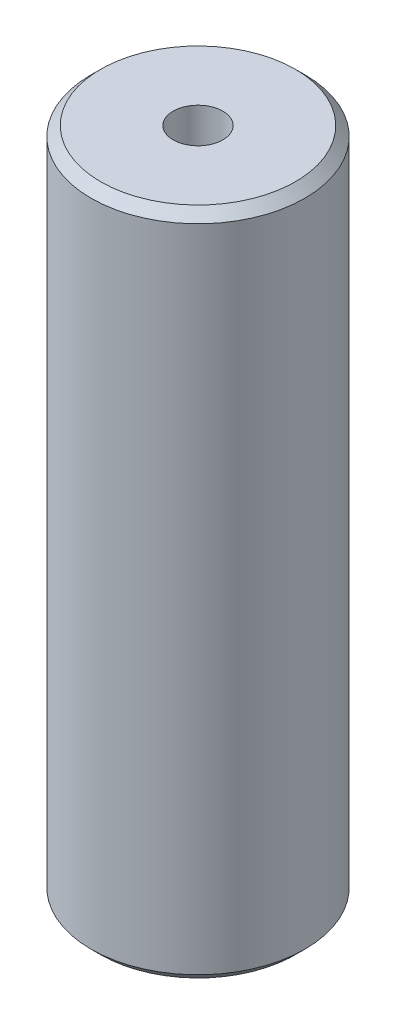
ISO-10303-21;
HEADER;
FILE_DESCRIPTION(('STEP AP214'),'2;1');
FILE_NAME('part.step','',(''),(''),'','','');
FILE_SCHEMA(('AUTOMOTIVE_DESIGN { 1 0 10303 214 1 1 1 1 }'));
ENDSEC;
DATA;
#1=APPLICATION_CONTEXT('core data for automotive mechanical design processes');
#2=APPLICATION_PROTOCOL_DEFINITION('international standard','automotive_design',2000,#1);
#3=PRODUCT_CONTEXT('',#1,'mechanical');
#4=PRODUCT('Part','Part','',(#3));
#5=PRODUCT_RELATED_PRODUCT_CATEGORY('part','',(#4));
#6=PRODUCT_DEFINITION_FORMATION('','',#4);
#7=PRODUCT_DEFINITION_CONTEXT('part definition',#1,'design');
#8=PRODUCT_DEFINITION('design','',#6,#7);
#9=PRODUCT_DEFINITION_SHAPE('','',#8);
#10=(LENGTH_UNIT() NAMED_UNIT(*) SI_UNIT(.MILLI.,.METRE.));
#11=(NAMED_UNIT(*) PLANE_ANGLE_UNIT() SI_UNIT($,.RADIAN.));
#12=(NAMED_UNIT(*) SI_UNIT($,.STERADIAN.) SOLID_ANGLE_UNIT());
#13=UNCERTAINTY_MEASURE_WITH_UNIT(LENGTH_MEASURE(1.E-05),#10,'distance_accuracy_value','');
#14=(GEOMETRIC_REPRESENTATION_CONTEXT(3) GLOBAL_UNCERTAINTY_ASSIGNED_CONTEXT((#13)) GLOBAL_UNIT_ASSIGNED_CONTEXT((#10,
#11,#12)) REPRESENTATION_CONTEXT('',''));
#15=CARTESIAN_POINT('',(0.,0.,0.));
#16=DIRECTION('',(0.,0.,1.));
#17=DIRECTION('',(1.,0.,0.));
#18=AXIS2_PLACEMENT_3D('',#15,#16,#17);
#19=CARTESIAN_POINT('',(0.,31.3021994107922,0.));
#20=DIRECTION('',(0.,-1.,0.));
#21=DIRECTION('',(0.,0.,-1.));
#22=AXIS2_PLACEMENT_3D('',#19,#20,#21);
#23=CYLINDRICAL_SURFACE('',#22,5.);
#24=CARTESIAN_POINT('',(0.,30.8571536067307,0.));
#25=DIRECTION('',(0.,1.,0.));
#26=DIRECTION('',(0.,0.,1.));
#27=AXIS2_PLACEMENT_3D('',#24,#25,#26);
#28=CIRCLE('',#27,5.);
#29=CARTESIAN_POINT('',(0.,30.8571536067307,5.));
#30=VERTEX_POINT('',#29);
#31=EDGE_CURVE('E50',#30,#30,#28,.F.);
#32=ORIENTED_EDGE('',*,*,#31,.T.);
#33=EDGE_LOOP('',(#32));
#34=FACE_BOUND('',#33,.T.);
#35=CARTESIAN_POINT('',(0.,0.445045804061475,0.));
#36=DIRECTION('',(0.,1.,0.));
#37=DIRECTION('',(0.,0.,1.));
#38=AXIS2_PLACEMENT_3D('',#35,#36,#37);
#39=CIRCLE('',#38,5.);
#40=CARTESIAN_POINT('',(0.,0.445045804061475,5.));
#41=VERTEX_POINT('',#40);
#42=EDGE_CURVE('E51',#41,#41,#39,.T.);
#43=ORIENTED_EDGE('',*,*,#42,.T.);
#44=EDGE_LOOP('',(#43));
#45=FACE_BOUND('',#44,.T.);
#46=ADVANCED_FACE('F39',(#34,#45),#23,.T.);
#47=CARTESIAN_POINT('',(0.,31.3021994107922,0.));
#48=DIRECTION('',(0.,1.,0.));
#49=DIRECTION('',(0.,0.,1.));
#50=AXIS2_PLACEMENT_3D('',#47,#48,#49);
#51=PLANE('',#50);
#52=CARTESIAN_POINT('',(0.,31.3021994107922,0.));
#53=DIRECTION('',(0.,1.,0.));
#54=DIRECTION('',(0.,0.,1.));
#55=AXIS2_PLACEMENT_3D('',#52,#53,#54);
#56=CIRCLE('',#55,4.55495419593852);
#57=CARTESIAN_POINT('',(0.,31.3021994107922,4.55495419593852));
#58=VERTEX_POINT('',#57);
#59=EDGE_CURVE('E54',#58,#58,#56,.T.);
#60=ORIENTED_EDGE('',*,*,#59,.T.);
#61=EDGE_LOOP('',(#60));
#62=FACE_BOUND('',#61,.T.);
#63=CARTESIAN_POINT('',(0.,31.3021994107922,0.));
#64=DIRECTION('',(0.,1.,0.));
#65=DIRECTION('',(0.,0.,1.));
#66=AXIS2_PLACEMENT_3D('',#63,#64,#65);
#67=CIRCLE('',#66,1.1643960092771);
#68=CARTESIAN_POINT('',(0.,31.3021994107922,1.1643960092771));
#69=VERTEX_POINT('',#68);
#70=EDGE_CURVE('E58',#69,#69,#67,.T.);
#71=ORIENTED_EDGE('',*,*,#70,.F.);
#72=EDGE_LOOP('',(#71));
#73=FACE_BOUND('',#72,.T.);
#74=ADVANCED_FACE('F69',(#62,#73),#51,.T.);
#75=CARTESIAN_POINT('',(0.,0.,0.));
#76=DIRECTION('',(0.,1.,0.));
#77=DIRECTION('',(0.,0.,1.));
#78=AXIS2_PLACEMENT_3D('',#75,#76,#77);
#79=PLANE('',#78);
#80=CARTESIAN_POINT('',(0.,0.,0.));
#81=DIRECTION('',(0.,1.,0.));
#82=DIRECTION('',(0.,0.,1.));
#83=AXIS2_PLACEMENT_3D('',#80,#81,#82);
#84=CIRCLE('',#83,4.55495419593852);
#85=CARTESIAN_POINT('',(0.,0.,4.55495419593852));
#86=VERTEX_POINT('',#85);
#87=EDGE_CURVE('E10',#86,#86,#84,.F.);
#88=ORIENTED_EDGE('',*,*,#87,.T.);
#89=EDGE_LOOP('',(#88));
#90=FACE_BOUND('',#89,.T.);
#91=CARTESIAN_POINT('',(0.,0.,0.));
#92=DIRECTION('',(0.,1.,0.));
#93=DIRECTION('',(0.,0.,1.));
#94=AXIS2_PLACEMENT_3D('',#91,#92,#93);
#95=CIRCLE('',#94,1.1643960092771);
#96=CARTESIAN_POINT('',(0.,0.,1.1643960092771));
#97=VERTEX_POINT('',#96);
#98=EDGE_CURVE('E63',#97,#97,#95,.T.);
#99=ORIENTED_EDGE('',*,*,#98,.T.);
#100=EDGE_LOOP('',(#99));
#101=FACE_BOUND('',#100,.T.);
#102=ADVANCED_FACE('F75',(#90,#101),#79,.F.);
#103=CARTESIAN_POINT('',(0.,31.3021994107922,0.));
#104=DIRECTION('',(0.,-1.,0.));
#105=DIRECTION('',(0.,0.,-1.));
#106=AXIS2_PLACEMENT_3D('',#103,#104,#105);
#107=CYLINDRICAL_SURFACE('',#106,1.1643960092771);
#108=ORIENTED_EDGE('',*,*,#70,.T.);
#109=EDGE_LOOP('',(#108));
#110=FACE_BOUND('',#109,.T.);
#111=ORIENTED_EDGE('',*,*,#98,.F.);
#112=EDGE_LOOP('',(#111));
#113=FACE_BOUND('',#112,.T.);
#114=ADVANCED_FACE('F70',(#110,#113),#107,.F.);
#115=CARTESIAN_POINT('',(0.,31.3021994107922,0.));
#116=DIRECTION('',(0.,-1.,0.));
#117=DIRECTION('',(0.,0.,-1.));
#118=AXIS2_PLACEMENT_3D('',#115,#116,#117);
#119=CONICAL_SURFACE('',#118,4.55495419593852,0.785398163397443);
#120=ORIENTED_EDGE('',*,*,#31,.F.);
#121=EDGE_LOOP('',(#120));
#122=FACE_BOUND('',#121,.T.);
#123=ORIENTED_EDGE('',*,*,#59,.F.);
#124=EDGE_LOOP('',(#123));
#125=FACE_BOUND('',#124,.T.);
#126=ADVANCED_FACE('F81',(#122,#125),#119,.T.);
#127=CARTESIAN_POINT('',(0.,0.445045804061475,0.));
#128=DIRECTION('',(0.,1.,0.));
#129=DIRECTION('',(0.,0.,1.));
#130=AXIS2_PLACEMENT_3D('',#127,#128,#129);
#131=CONICAL_SURFACE('',#130,5.,0.785398163397455);
#132=ORIENTED_EDGE('',*,*,#87,.F.);
#133=EDGE_LOOP('',(#132));
#134=FACE_BOUND('',#133,.T.);
#135=ORIENTED_EDGE('',*,*,#42,.F.);
#136=EDGE_LOOP('',(#135));
#137=FACE_BOUND('',#136,.T.);
#138=ADVANCED_FACE('F45',(#134,#137),#131,.T.);
#139=CLOSED_SHELL('',(#46,#74,#102,#114,#126,#138));
#140=MANIFOLD_SOLID_BREP('B2',#139);
#141=ADVANCED_BREP_SHAPE_REPRESENTATION('',(#18,#140),#14);
#142=SHAPE_DEFINITION_REPRESENTATION(#9,#141);
ENDSEC;
END-ISO-10303-21;
